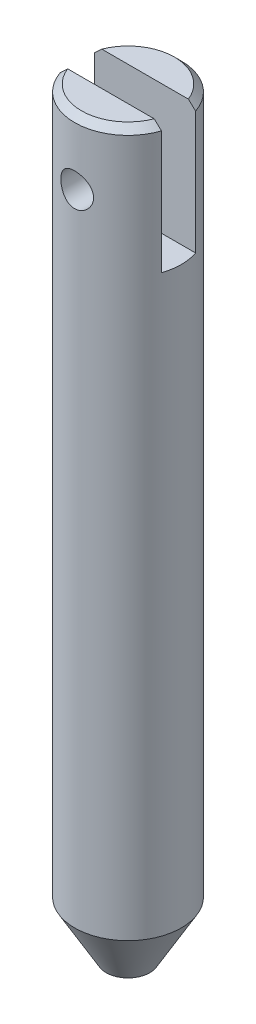
ISO-10303-21;
HEADER;
FILE_DESCRIPTION(('STEP AP214'),'2;1');
FILE_NAME('part.step','',(''),(''),'','','');
FILE_SCHEMA(('AUTOMOTIVE_DESIGN { 1 0 10303 214 1 1 1 1 }'));
ENDSEC;
DATA;
#1=APPLICATION_CONTEXT('core data for automotive mechanical design processes');
#2=APPLICATION_PROTOCOL_DEFINITION('international standard','automotive_design',2000,#1);
#3=PRODUCT_CONTEXT('',#1,'mechanical');
#4=PRODUCT('Part','Part','',(#3));
#5=PRODUCT_RELATED_PRODUCT_CATEGORY('part','',(#4));
#6=PRODUCT_DEFINITION_FORMATION('','',#4);
#7=PRODUCT_DEFINITION_CONTEXT('part definition',#1,'design');
#8=PRODUCT_DEFINITION('design','',#6,#7);
#9=PRODUCT_DEFINITION_SHAPE('','',#8);
#10=(LENGTH_UNIT() NAMED_UNIT(*) SI_UNIT(.MILLI.,.METRE.));
#11=(NAMED_UNIT(*) PLANE_ANGLE_UNIT() SI_UNIT($,.RADIAN.));
#12=(NAMED_UNIT(*) SI_UNIT($,.STERADIAN.) SOLID_ANGLE_UNIT());
#13=UNCERTAINTY_MEASURE_WITH_UNIT(LENGTH_MEASURE(1.E-05),#10,'distance_accuracy_value','');
#14=(GEOMETRIC_REPRESENTATION_CONTEXT(3) GLOBAL_UNCERTAINTY_ASSIGNED_CONTEXT((#13)) GLOBAL_UNIT_ASSIGNED_CONTEXT((#10,
#11,#12)) REPRESENTATION_CONTEXT('',''));
#15=CARTESIAN_POINT('',(0.,0.,0.));
#16=DIRECTION('',(0.,0.,1.));
#17=DIRECTION('',(1.,0.,0.));
#18=AXIS2_PLACEMENT_3D('',#15,#16,#17);
#19=CARTESIAN_POINT('',(0.,-55.6,0.));
#20=DIRECTION('',(0.,-1.,0.));
#21=DIRECTION('',(0.,0.,-1.));
#22=AXIS2_PLACEMENT_3D('',#19,#20,#21);
#23=PLANE('',#22);
#24=CARTESIAN_POINT('',(0.,-55.6000000000267,0.));
#25=DIRECTION('',(0.,1.,0.));
#26=DIRECTION('',(-1.,0.,0.));
#27=AXIS2_PLACEMENT_3D('',#24,#25,#26);
#28=CIRCLE('',#27,1.60059892323261);
#29=CARTESIAN_POINT('',(-1.60059892323261,-55.6000000000267,0.));
#30=VERTEX_POINT('',#29);
#31=EDGE_CURVE('E83',#30,#30,#28,.T.);
#32=ORIENTED_EDGE('',*,*,#31,.F.);
#33=EDGE_LOOP('',(#32));
#34=FACE_BOUND('',#33,.T.);
#35=ADVANCED_FACE('F16',(#34),#23,.T.);
#36=CARTESIAN_POINT('',(0.,0.,0.));
#37=DIRECTION('',(0.,1.,0.));
#38=DIRECTION('',(0.,0.,1.));
#39=AXIS2_PLACEMENT_3D('',#36,#37,#38);
#40=PLANE('',#39);
#41=CARTESIAN_POINT('',(0.,-5.6843418860808E-11,0.));
#42=DIRECTION('',(0.,-1.,0.));
#43=DIRECTION('',(0.,0.,-1.));
#44=AXIS2_PLACEMENT_3D('',#41,#42,#43);
#45=CIRCLE('',#44,3.41000000003078);
#46=CARTESIAN_POINT('',(-3.17263297595533,-4.35386597477304E-11,-1.25));
#47=VERTEX_POINT('',#46);
#48=CARTESIAN_POINT('',(3.17263297593908,-2.8421709430404E-11,-1.25));
#49=VERTEX_POINT('',#48);
#50=EDGE_CURVE('E77',#47,#49,#45,.T.);
#51=ORIENTED_EDGE('',*,*,#50,.F.);
#52=DIRECTION('',(-1.,0.,0.));
#53=VECTOR('',#52,1.);
#54=CARTESIAN_POINT('',(-3.70480768731657,0.,-1.25));
#55=LINE('',#54,#53);
#56=EDGE_CURVE('E80',#47,#49,#55,.F.);
#57=ORIENTED_EDGE('',*,*,#56,.T.);
#58=EDGE_LOOP('',(#51,#57));
#59=FACE_BOUND('',#58,.T.);
#60=ADVANCED_FACE('F78',(#59),#40,.T.);
#61=CARTESIAN_POINT('',(0.,0.,0.));
#62=DIRECTION('',(0.,1.,0.));
#63=DIRECTION('',(0.,0.,1.));
#64=AXIS2_PLACEMENT_3D('',#61,#62,#63);
#65=PLANE('',#64);
#66=DIRECTION('',(1.,0.,0.));
#67=VECTOR('',#66,1.);
#68=CARTESIAN_POINT('',(-3.70480768731658,0.,1.25));
#69=LINE('',#68,#67);
#70=CARTESIAN_POINT('',(3.17263297595096,-3.94731268170688E-11,1.25));
#71=VERTEX_POINT('',#70);
#72=CARTESIAN_POINT('',(-3.17263297593908,-2.8421709430404E-11,1.25));
#73=VERTEX_POINT('',#72);
#74=EDGE_CURVE('E156',#71,#73,#69,.F.);
#75=ORIENTED_EDGE('',*,*,#74,.T.);
#76=CARTESIAN_POINT('',(0.,-5.6843418860808E-11,0.));
#77=DIRECTION('',(0.,-1.,0.));
#78=DIRECTION('',(0.,0.,-1.));
#79=AXIS2_PLACEMENT_3D('',#76,#77,#78);
#80=CIRCLE('',#79,3.41000000003078);
#81=EDGE_CURVE('E89',#71,#73,#80,.T.);
#82=ORIENTED_EDGE('',*,*,#81,.F.);
#83=EDGE_LOOP('',(#75,#82));
#84=FACE_BOUND('',#83,.T.);
#85=ADVANCED_FACE('F162',(#84),#65,.T.);
#86=CARTESIAN_POINT('',(0.,-0.50000000004502,0.));
#87=DIRECTION('',(0.,-1.,0.));
#88=DIRECTION('',(0.,0.,-1.));
#89=AXIS2_PLACEMENT_3D('',#86,#87,#88);
#90=CONICAL_SURFACE('',#89,3.91000000001895,0.785398163397448);
#91=CARTESIAN_POINT('',(-3.17263297593229,-2.21038523908453E-11,1.25));
#92=CARTESIAN_POINT('',(-3.21718377374796,-0.0414502674763203,1.25));
#93=CARTESIAN_POINT('',(-3.26167664671908,-0.0829627251358861,1.25));
#94=CARTESIAN_POINT('',(-3.35055742833952,-0.166099409545555,1.25));
#95=CARTESIAN_POINT('',(-3.39494533752697,-0.207723635720303,1.25));
#96=CARTESIAN_POINT('',(-3.48362749109901,-0.291071631225922,1.25));
#97=CARTESIAN_POINT('',(-3.52792173557526,-0.332795400459289,1.25));
#98=CARTESIAN_POINT('',(-3.61642582244306,-0.416332820839537,1.25));
#99=CARTESIAN_POINT('',(-3.66063566440008,-0.458146472446805,1.25));
#100=CARTESIAN_POINT('',(-3.70480768730356,-0.500000000013731,1.25));
#101=B_SPLINE_CURVE_WITH_KNOTS('',3,(#91,#92,#93,#94,#95,#96,#97,#98,#99,#100),.UNSPECIFIED.,
.F.,.F.,(4,2,2,2,4),(0.,0.182554207026802,0.365107476108087,0.547660566448,0.730214594082766),.UNSPECIFIED.);
#102=CARTESIAN_POINT('',(-3.70480768731007,-0.500000000006866,1.25));
#103=VERTEX_POINT('',#102);
#104=EDGE_CURVE('E149',#73,#103,#101,.T.);
#105=ORIENTED_EDGE('',*,*,#104,.T.);
#106=CARTESIAN_POINT('',(0.,-0.499999999999987,0.));
#107=DIRECTION('',(0.,-1.,0.));
#108=DIRECTION('',(0.,0.,-1.));
#109=AXIS2_PLACEMENT_3D('',#106,#107,#108);
#110=CIRCLE('',#109,3.91);
#111=CARTESIAN_POINT('',(3.70480768731007,-0.500000000006858,1.25));
#112=VERTEX_POINT('',#111);
#113=EDGE_CURVE('E217',#112,#103,#110,.T.);
#114=ORIENTED_EDGE('',*,*,#113,.F.);
#115=CARTESIAN_POINT('',(3.70480768730356,-0.500000000013728,1.25));
#116=CARTESIAN_POINT('',(3.66063566440008,-0.458146472446803,1.25));
#117=CARTESIAN_POINT('',(3.61642582244306,-0.416332820839535,1.25));
#118=CARTESIAN_POINT('',(3.52792173557526,-0.332795400459288,1.25));
#119=CARTESIAN_POINT('',(3.48362749109901,-0.291071631225921,1.25));
#120=CARTESIAN_POINT('',(3.39494533752697,-0.207723635720302,1.25));
#121=CARTESIAN_POINT('',(3.35055742833952,-0.166099409545554,1.25));
#122=CARTESIAN_POINT('',(3.26167664671907,-0.0829627251358853,1.25));
#123=CARTESIAN_POINT('',(3.21718377374796,-0.0414502674763195,1.25));
#124=CARTESIAN_POINT('',(3.17263297593229,-2.21028607428023E-11,1.25));
#125=B_SPLINE_CURVE_WITH_KNOTS('',3,(#115,#116,#117,#118,#119,#120,#121,#122,#123,#124),
.UNSPECIFIED.,.F.,.F.,(4,2,2,2,4),(0.,0.182554027634765,0.365107117974678,0.547660387055963,
0.730214594082764),.UNSPECIFIED.);
#126=EDGE_CURVE('E142',#112,#71,#125,.T.);
#127=ORIENTED_EDGE('',*,*,#126,.T.);
#128=ORIENTED_EDGE('',*,*,#81,.T.);
#129=EDGE_LOOP('',(#105,#114,#127,#128));
#130=FACE_BOUND('',#129,.T.);
#131=ADVANCED_FACE('F157',(#130),#90,.T.);
#132=CARTESIAN_POINT('',(0.,-4.76,3.91));
#133=DIRECTION('',(0.,0.,-1.));
#134=DIRECTION('',(-1.,0.,0.));
#135=AXIS2_PLACEMENT_3D('',#132,#133,#134);
#136=CYLINDRICAL_SURFACE('',#135,1.2);
#137=CARTESIAN_POINT('',(0.,-4.76,1.25));
#138=DIRECTION('',(0.,0.,-1.));
#139=DIRECTION('',(-1.,0.,0.));
#140=AXIS2_PLACEMENT_3D('',#137,#138,#139);
#141=CIRCLE('',#140,1.2);
#142=CARTESIAN_POINT('',(-1.2,-4.76,1.25));
#143=VERTEX_POINT('',#142);
#144=EDGE_CURVE('E211',#143,#143,#141,.T.);
#145=ORIENTED_EDGE('',*,*,#144,.T.);
#146=EDGE_LOOP('',(#145));
#147=FACE_BOUND('',#146,.T.);
#148=CARTESIAN_POINT('',(0.,-3.56,3.91));
#149=CARTESIAN_POINT('',(0.065722378512767,-3.56000280389594,3.90999807145559));
#150=CARTESIAN_POINT('',(0.131479183145352,-3.5654203888806,3.90832598380927));
#151=CARTESIAN_POINT('',(0.261101907980637,-3.58690562613876,3.90181358646052));
#152=CARTESIAN_POINT('',(0.324966062811949,-3.60298291368633,3.89697041047006));
#153=CARTESIAN_POINT('',(0.448872965856192,-3.64519553262783,3.88464723393661));
#154=CARTESIAN_POINT('',(0.508922239038861,-3.67131312016367,3.87717188708176));
#155=CARTESIAN_POINT('',(0.623778999144302,-3.73279749118392,3.86035923757977));
#156=CARTESIAN_POINT('',(0.678586502320682,-3.76816424598737,3.85102194070642));
#157=CARTESIAN_POINT('',(0.783053518515575,-3.84825714959003,3.83116593701344));
#158=CARTESIAN_POINT('',(0.832534750568688,-3.8932096039702,3.82062219502528));
#159=CARTESIAN_POINT('',(0.923397701988342,-3.99072767633101,3.79968627814832));
#160=CARTESIAN_POINT('',(0.964776372994426,-4.04329614673171,3.78929416165996));
#161=CARTESIAN_POINT('',(1.03921589947752,-4.15609128196176,3.76956924464955));
#162=CARTESIAN_POINT('',(1.07205234305194,-4.21647193692835,3.76026799729355));
#163=CARTESIAN_POINT('',(1.12700104610112,-4.34219346183846,3.74416830205214));
#164=CARTESIAN_POINT('',(1.14912632294408,-4.40752819873241,3.73736681861763));
#165=CARTESIAN_POINT('',(1.17693492326708,-4.52097540041954,3.72868103568987));
#166=CARTESIAN_POINT('',(1.18556731647261,-4.56831921209903,3.72593167156208));
#167=CARTESIAN_POINT('',(1.19710070715213,-4.66376918818745,3.72224213778086));
#168=CARTESIAN_POINT('',(1.200002103363,-4.71187529932425,3.72130184226072));
#169=CARTESIAN_POINT('',(1.19999713109093,-4.82564030574186,3.7213058439595));
#170=CARTESIAN_POINT('',(1.19459260678549,-4.89131519536456,3.72306062298777));
#171=CARTESIAN_POINT('',(1.17316397277972,-5.02076744026995,3.72986690715028));
#172=CARTESIAN_POINT('',(1.15712993661872,-5.0845429635867,3.73492149377082));
#173=CARTESIAN_POINT('',(1.11504363344616,-5.20826185270835,3.74770019142344));
#174=CARTESIAN_POINT('',(1.0890110672815,-5.26821248579201,3.75541904983145));
#175=CARTESIAN_POINT('',(1.02772739517388,-5.38290124926764,3.77264964549501));
#176=CARTESIAN_POINT('',(0.992476127922138,-5.4376392884268,3.78216141412207));
#177=CARTESIAN_POINT('',(0.912505024256181,-5.54217254066448,3.80225999182101));
#178=CARTESIAN_POINT('',(0.867532844963987,-5.59177019136253,3.8128704923336));
#179=CARTESIAN_POINT('',(0.769925039298974,-5.68286130204585,3.83377136371792));
#180=CARTESIAN_POINT('',(0.717286876858446,-5.72435206942634,3.84406162727594));
#181=CARTESIAN_POINT('',(0.604418742837527,-5.79891936565901,3.8634344442746));
#182=CARTESIAN_POINT('',(0.544046572995955,-5.8317894255578,3.87248524093107));
#183=CARTESIAN_POINT('',(0.418342401373228,-5.88680273412799,3.88806934654223));
#184=CARTESIAN_POINT('',(0.353016346938896,-5.90895861696445,3.89460561875617));
#185=CARTESIAN_POINT('',(0.239490527463797,-5.93684444053757,3.90294098432303));
#186=CARTESIAN_POINT('',(0.192052632812199,-5.94551100493052,3.90557371341182));
#187=CARTESIAN_POINT('',(0.0964159724672516,-5.95708964641945,3.90910387839514));
#188=CARTESIAN_POINT('',(0.0482172510417467,-5.96000205707945,3.91000141487743));
#189=CARTESIAN_POINT('',(-0.0657223785127661,-5.95999719610406,3.90999807145559));
#190=CARTESIAN_POINT('',(-0.131479183145351,-5.95457961111941,3.90832598380927));
#191=CARTESIAN_POINT('',(-0.261101907980636,-5.93309437386124,3.90181358646052));
#192=CARTESIAN_POINT('',(-0.324966062811948,-5.91701708631367,3.89697041047006));
#193=CARTESIAN_POINT('',(-0.448872965856191,-5.87480446737217,3.88464723393661));
#194=CARTESIAN_POINT('',(-0.50892223903886,-5.84868687983633,3.87717188708176));
#195=CARTESIAN_POINT('',(-0.623778999144301,-5.78720250881608,3.86035923757977));
#196=CARTESIAN_POINT('',(-0.678586502320682,-5.75183575401263,3.85102194070642));
#197=CARTESIAN_POINT('',(-0.783053518515574,-5.67174285040997,3.83116593701344));
#198=CARTESIAN_POINT('',(-0.832534750568688,-5.6267903960298,3.82062219502528));
#199=CARTESIAN_POINT('',(-0.923397701988341,-5.529272323669,3.79968627814832));
#200=CARTESIAN_POINT('',(-0.964776372994426,-5.47670385326829,3.78929416165996));
#201=CARTESIAN_POINT('',(-1.03921589947752,-5.36390871803824,3.76956924464955));
#202=CARTESIAN_POINT('',(-1.07205234305194,-5.30352806307166,3.76026799729355));
#203=CARTESIAN_POINT('',(-1.12700104610112,-5.17780653816154,3.74416830205214));
#204=CARTESIAN_POINT('',(-1.14912632294408,-5.11247180126759,3.73736681861763));
#205=CARTESIAN_POINT('',(-1.17693492326708,-4.99902459958046,3.72868103568987));
#206=CARTESIAN_POINT('',(-1.18556731647261,-4.95168078790098,3.72593167156208));
#207=CARTESIAN_POINT('',(-1.19710070715213,-4.85623081181257,3.72224213778086));
#208=CARTESIAN_POINT('',(-1.200002103363,-4.80812470067577,3.72130184226072));
#209=CARTESIAN_POINT('',(-1.19999713109093,-4.69435969425817,3.7213058439595));
#210=CARTESIAN_POINT('',(-1.19459260678549,-4.62868480463546,3.72306062298777));
#211=CARTESIAN_POINT('',(-1.17316397277973,-4.49923255973007,3.72986690715028));
#212=CARTESIAN_POINT('',(-1.15712993661873,-4.43545703641332,3.73492149377082));
#213=CARTESIAN_POINT('',(-1.11504363344617,-4.31173814729167,3.74770019142344));
#214=CARTESIAN_POINT('',(-1.08901106728151,-4.25178751420801,3.75541904983145));
#215=CARTESIAN_POINT('',(-1.02772739517389,-4.13709875073239,3.772649645495));
#216=CARTESIAN_POINT('',(-0.992476127922152,-4.08236071157322,3.78216141412207));
#217=CARTESIAN_POINT('',(-0.912505024256197,-3.97782745933554,3.80225999182101));
#218=CARTESIAN_POINT('',(-0.867532844964004,-3.92822980863749,3.81287049233359));
#219=CARTESIAN_POINT('',(-0.769925039298994,-3.83713869795417,3.83377136371792));
#220=CARTESIAN_POINT('',(-0.717286876858466,-3.79564793057368,3.84406162727594));
#221=CARTESIAN_POINT('',(-0.604418742837549,-3.721080634341,3.8634344442746));
#222=CARTESIAN_POINT('',(-0.544046572995979,-3.68821057444222,3.87248524093107));
#223=CARTESIAN_POINT('',(-0.418342401373253,-3.63319726587202,3.88806934654223));
#224=CARTESIAN_POINT('',(-0.353016346938921,-3.61104138303556,3.89460561875617));
#225=CARTESIAN_POINT('',(-0.239490527463819,-3.58315555946243,3.90294098432303));
#226=CARTESIAN_POINT('',(-0.192052632812217,-3.57448899506948,3.90557371341182));
#227=CARTESIAN_POINT('',(-0.0964159724672605,-3.56291035358055,3.90910387839514));
#228=CARTESIAN_POINT('',(-0.0482172510417508,-3.55999794292055,3.91000141487743));
#229=CARTESIAN_POINT('',(0.,-3.56,3.91));
#230=B_SPLINE_CURVE_WITH_KNOTS('',3,(#148,#149,#150,#151,#152,#153,#154,#155,#156,#157,#158,
#159,#160,#161,#162,#163,#164,#165,#166,#167,#168,#169,#170,#171,#172,#173,#174,#175,#176,#177,
#178,#179,#180,#181,#182,#183,#184,#185,#186,#187,#188,#189,#190,#191,#192,#193,#194,#195,#196,
#197,#198,#199,#200,#201,#202,#203,#204,#205,#206,#207,#208,#209,#210,#211,#212,#213,#214,#215,
#216,#217,#218,#219,#220,#221,#222,#223,#224,#225,#226,#227,#228,#229),.UNSPECIFIED.,.T.,.F.,(4,
2,2,2,2,2,2,2,2,2,2,2,2,2,2,2,2,2,2,2,2,2,2,2,2,2,2,2,2,2,2,2,2,2,2,2,2,2,2,2,4),(0.,
0.196986922491724,0.3941521440725,0.590970512758818,0.787788271133657,0.989903848793997,
1.19209532126549,1.3991580279064,1.60596845385973,1.7502200828624,1.89446167513482,
2.09120185397245,2.28812601961167,2.484664145164,2.68120570996956,2.88364384094696,
3.08614909546892,3.29313465126073,3.49987553073289,3.64440344890142,3.78892298864814,
3.98590991113986,4.18307513272064,4.37989350140696,4.5767112597818,4.77882683744214,
4.98101830991363,5.18808101655454,5.39489144250787,5.53914307151052,5.68338466378293,
5.88012484262057,6.07704900825979,6.27358713381212,6.47012869861768,6.67256682959507,
6.87507208411703,7.08205763990884,7.288798519381,7.43332643754955,7.57784597729628),.UNSPECIFIED.);
#231=CARTESIAN_POINT('',(0.,-3.56,3.91));
#232=VERTEX_POINT('',#231);
#233=EDGE_CURVE('E110',#232,#232,#230,.T.);
#234=ORIENTED_EDGE('',*,*,#233,.F.);
#235=EDGE_LOOP('',(#234));
#236=FACE_BOUND('',#235,.T.);
#237=ADVANCED_FACE('F161',(#147,#236),#136,.F.);
#238=CARTESIAN_POINT('',(0.,-51.5999999999508,0.));
#239=DIRECTION('',(0.,1.,0.));
#240=DIRECTION('',(-1.,0.,0.));
#241=AXIS2_PLACEMENT_3D('',#238,#239,#240);
#242=CONICAL_SURFACE('',#241,3.91000000001895,0.523598775595298);
#243=CARTESIAN_POINT('',(0.,-51.6,0.));
#244=DIRECTION('',(0.,-1.,0.));
#245=DIRECTION('',(0.,0.,-1.));
#246=AXIS2_PLACEMENT_3D('',#243,#244,#245);
#247=CIRCLE('',#246,3.91);
#248=CARTESIAN_POINT('',(0.,-51.6,-3.91));
#249=VERTEX_POINT('',#248);
#250=EDGE_CURVE('E107',#249,#249,#247,.F.);
#251=ORIENTED_EDGE('',*,*,#250,.F.);
#252=EDGE_LOOP('',(#251));
#253=FACE_BOUND('',#252,.T.);
#254=ORIENTED_EDGE('',*,*,#31,.T.);
#255=EDGE_LOOP('',(#254));
#256=FACE_BOUND('',#255,.T.);
#257=ADVANCED_FACE('F196',(#253,#256),#242,.T.);
#258=CARTESIAN_POINT('',(0.,-4.76,3.91));
#259=DIRECTION('',(0.,0.,-1.));
#260=DIRECTION('',(-1.,0.,0.));
#261=AXIS2_PLACEMENT_3D('',#258,#259,#260);
#262=CYLINDRICAL_SURFACE('',#261,1.2);
#263=CARTESIAN_POINT('',(0.,-4.76,-1.25));
#264=DIRECTION('',(0.,0.,-1.));
#265=DIRECTION('',(-1.,0.,0.));
#266=AXIS2_PLACEMENT_3D('',#263,#264,#265);
#267=CIRCLE('',#266,1.2);
#268=CARTESIAN_POINT('',(-1.2,-4.76,-1.25));
#269=VERTEX_POINT('',#268);
#270=EDGE_CURVE('E82',#269,#269,#267,.F.);
#271=ORIENTED_EDGE('',*,*,#270,.T.);
#272=EDGE_LOOP('',(#271));
#273=FACE_BOUND('',#272,.T.);
#274=CARTESIAN_POINT('',(0.,-5.96,-3.91));
#275=CARTESIAN_POINT('',(0.0657223785127667,-5.95999719610406,-3.90999807145559));
#276=CARTESIAN_POINT('',(0.131479183145352,-5.95457961111941,-3.90832598380927));
#277=CARTESIAN_POINT('',(0.261101907980637,-5.93309437386124,-3.90181358646052));
#278=CARTESIAN_POINT('',(0.324966062811949,-5.91701708631367,-3.89697041047006));
#279=CARTESIAN_POINT('',(0.448872965856192,-5.87480446737217,-3.88464723393661));
#280=CARTESIAN_POINT('',(0.508922239038861,-5.84868687983633,-3.87717188708176));
#281=CARTESIAN_POINT('',(0.623778999144302,-5.78720250881608,-3.86035923757977));
#282=CARTESIAN_POINT('',(0.678586502320682,-5.75183575401263,-3.85102194070642));
#283=CARTESIAN_POINT('',(0.783053518515574,-5.67174285040997,-3.83116593701344));
#284=CARTESIAN_POINT('',(0.832534750568688,-5.6267903960298,-3.82062219502528));
#285=CARTESIAN_POINT('',(0.923397701988341,-5.529272323669,-3.79968627814832));
#286=CARTESIAN_POINT('',(0.964776372994426,-5.47670385326829,-3.78929416165996));
#287=CARTESIAN_POINT('',(1.03921589947752,-5.36390871803824,-3.76956924464955));
#288=CARTESIAN_POINT('',(1.07205234305194,-5.30352806307166,-3.76026799729355));
#289=CARTESIAN_POINT('',(1.12700104610112,-5.17780653816154,-3.74416830205214));
#290=CARTESIAN_POINT('',(1.14912632294408,-5.11247180126759,-3.73736681861762));
#291=CARTESIAN_POINT('',(1.17693492326708,-4.99902459958046,-3.72868103568987));
#292=CARTESIAN_POINT('',(1.18556731647261,-4.95168078790097,-3.72593167156208));
#293=CARTESIAN_POINT('',(1.19710070715213,-4.85623081181255,-3.72224213778086));
#294=CARTESIAN_POINT('',(1.200002103363,-4.80812470067575,-3.72130184226072));
#295=CARTESIAN_POINT('',(1.19999713109093,-4.69435969425814,-3.7213058439595));
#296=CARTESIAN_POINT('',(1.19459260678549,-4.62868480463544,-3.72306062298777));
#297=CARTESIAN_POINT('',(1.17316397277972,-4.49923255973005,-3.72986690715028));
#298=CARTESIAN_POINT('',(1.15712993661872,-4.4354570364133,-3.73492149377082));
#299=CARTESIAN_POINT('',(1.11504363344617,-4.31173814729165,-3.74770019142344));
#300=CARTESIAN_POINT('',(1.0890110672815,-4.25178751420799,-3.75541904983145));
#301=CARTESIAN_POINT('',(1.02772739517388,-4.13709875073237,-3.77264964549501));
#302=CARTESIAN_POINT('',(0.992476127922139,-4.0823607115732,-3.78216141412207));
#303=CARTESIAN_POINT('',(0.912505024256181,-3.97782745933552,-3.80225999182101));
#304=CARTESIAN_POINT('',(0.867532844963987,-3.92822980863747,-3.8128704923336));
#305=CARTESIAN_POINT('',(0.769925039298974,-3.83713869795416,-3.83377136371792));
#306=CARTESIAN_POINT('',(0.717286876858446,-3.79564793057367,-3.84406162727594));
#307=CARTESIAN_POINT('',(0.604418742837527,-3.72108063434099,-3.8634344442746));
#308=CARTESIAN_POINT('',(0.544046572995956,-3.6882105744422,-3.87248524093107));
#309=CARTESIAN_POINT('',(0.418342401373229,-3.63319726587201,-3.88806934654223));
#310=CARTESIAN_POINT('',(0.353016346938896,-3.61104138303555,-3.89460561875617));
#311=CARTESIAN_POINT('',(0.239490527463797,-3.58315555946243,-3.90294098432303));
#312=CARTESIAN_POINT('',(0.192052632812199,-3.57448899506948,-3.90557371341182));
#313=CARTESIAN_POINT('',(0.0964159724672515,-3.56291035358055,-3.90910387839514));
#314=CARTESIAN_POINT('',(0.0482172510417463,-3.55999794292055,-3.91000141487743));
#315=CARTESIAN_POINT('',(-0.065722378512767,-3.56000280389594,-3.90999807145559));
#316=CARTESIAN_POINT('',(-0.131479183145352,-3.5654203888806,-3.90832598380927));
#317=CARTESIAN_POINT('',(-0.261101907980637,-3.58690562613876,-3.90181358646052));
#318=CARTESIAN_POINT('',(-0.324966062811949,-3.60298291368633,-3.89697041047006));
#319=CARTESIAN_POINT('',(-0.448872965856192,-3.64519553262783,-3.88464723393661));
#320=CARTESIAN_POINT('',(-0.508922239038861,-3.67131312016367,-3.87717188708176));
#321=CARTESIAN_POINT('',(-0.623778999144303,-3.73279749118392,-3.86035923757977));
#322=CARTESIAN_POINT('',(-0.678586502320683,-3.76816424598737,-3.85102194070642));
#323=CARTESIAN_POINT('',(-0.783053518515575,-3.84825714959003,-3.83116593701344));
#324=CARTESIAN_POINT('',(-0.832534750568688,-3.8932096039702,-3.82062219502528));
#325=CARTESIAN_POINT('',(-0.923397701988341,-3.99072767633101,-3.79968627814832));
#326=CARTESIAN_POINT('',(-0.964776372994426,-4.04329614673171,-3.78929416165996));
#327=CARTESIAN_POINT('',(-1.03921589947752,-4.15609128196176,-3.76956924464955));
#328=CARTESIAN_POINT('',(-1.07205234305194,-4.21647193692835,-3.76026799729355));
#329=CARTESIAN_POINT('',(-1.12700104610112,-4.34219346183846,-3.74416830205214));
#330=CARTESIAN_POINT('',(-1.14912632294408,-4.40752819873241,-3.73736681861762));
#331=CARTESIAN_POINT('',(-1.17693492326708,-4.52097540041954,-3.72868103568987));
#332=CARTESIAN_POINT('',(-1.18556731647261,-4.56831921209902,-3.72593167156208));
#333=CARTESIAN_POINT('',(-1.19710070715213,-4.66376918818743,-3.72224213778086));
#334=CARTESIAN_POINT('',(-1.200002103363,-4.71187529932423,-3.72130184226072));
#335=CARTESIAN_POINT('',(-1.19999713109093,-4.82564030574183,-3.7213058439595));
#336=CARTESIAN_POINT('',(-1.19459260678549,-4.89131519536454,-3.72306062298777));
#337=CARTESIAN_POINT('',(-1.17316397277972,-5.02076744026993,-3.72986690715028));
#338=CARTESIAN_POINT('',(-1.15712993661873,-5.08454296358668,-3.73492149377082));
#339=CARTESIAN_POINT('',(-1.11504363344617,-5.20826185270833,-3.74770019142344));
#340=CARTESIAN_POINT('',(-1.08901106728151,-5.26821248579199,-3.75541904983145));
#341=CARTESIAN_POINT('',(-1.02772739517389,-5.38290124926761,-3.77264964549501));
#342=CARTESIAN_POINT('',(-0.992476127922152,-5.43763928842677,-3.78216141412207));
#343=CARTESIAN_POINT('',(-0.912505024256196,-5.54217254066446,-3.80225999182101));
#344=CARTESIAN_POINT('',(-0.867532844964004,-5.59177019136251,-3.81287049233359));
#345=CARTESIAN_POINT('',(-0.769925039298993,-5.68286130204583,-3.83377136371792));
#346=CARTESIAN_POINT('',(-0.717286876858465,-5.72435206942632,-3.84406162727594));
#347=CARTESIAN_POINT('',(-0.604418742837549,-5.798919365659,-3.8634344442746));
#348=CARTESIAN_POINT('',(-0.544046572995979,-5.83178942555778,-3.87248524093107));
#349=CARTESIAN_POINT('',(-0.418342401373253,-5.88680273412798,-3.88806934654223));
#350=CARTESIAN_POINT('',(-0.353016346938921,-5.90895861696444,-3.89460561875617));
#351=CARTESIAN_POINT('',(-0.239490527463818,-5.93684444053757,-3.90294098432303));
#352=CARTESIAN_POINT('',(-0.192052632812216,-5.94551100493052,-3.90557371341182));
#353=CARTESIAN_POINT('',(-0.0964159724672601,-5.95708964641945,-3.90910387839514));
#354=CARTESIAN_POINT('',(-0.0482172510417507,-5.96000205707945,-3.91000141487743));
#355=CARTESIAN_POINT('',(0.,-5.96,-3.91));
#356=B_SPLINE_CURVE_WITH_KNOTS('',3,(#274,#275,#276,#277,#278,#279,#280,#281,#282,#283,#284,
#285,#286,#287,#288,#289,#290,#291,#292,#293,#294,#295,#296,#297,#298,#299,#300,#301,#302,#303,
#304,#305,#306,#307,#308,#309,#310,#311,#312,#313,#314,#315,#316,#317,#318,#319,#320,#321,#322,
#323,#324,#325,#326,#327,#328,#329,#330,#331,#332,#333,#334,#335,#336,#337,#338,#339,#340,#341,
#342,#343,#344,#345,#346,#347,#348,#349,#350,#351,#352,#353,#354,#355),.UNSPECIFIED.,.T.,.F.,(4,
2,2,2,2,2,2,2,2,2,2,2,2,2,2,2,2,2,2,2,2,2,2,2,2,2,2,2,2,2,2,2,2,2,2,2,2,2,2,2,4),(0.,
0.196986922491723,0.3941521440725,0.590970512758818,0.787788271133657,0.989903848793996,
1.19209532126549,1.3991580279064,1.60596845385973,1.7502200828624,1.89446167513482,
2.09120185397245,2.28812601961167,2.484664145164,2.68120570996956,2.88364384094696,
3.08614909546892,3.29313465126073,3.49987553073289,3.64440344890142,3.78892298864814,
3.98590991113986,4.18307513272064,4.37989350140696,4.5767112597818,4.77882683744214,
4.98101830991363,5.18808101655454,5.39489144250788,5.53914307151052,5.68338466378293,
5.88012484262057,6.07704900825978,6.27358713381211,6.47012869861768,6.67256682959507,
6.87507208411703,7.08205763990884,7.288798519381,7.43332643754955,7.57784597729628),.UNSPECIFIED.);
#357=CARTESIAN_POINT('',(0.,-5.96,-3.91));
#358=VERTEX_POINT('',#357);
#359=EDGE_CURVE('E104',#358,#358,#356,.T.);
#360=ORIENTED_EDGE('',*,*,#359,.F.);
#361=EDGE_LOOP('',(#360));
#362=FACE_BOUND('',#361,.T.);
#363=ADVANCED_FACE('F125',(#273,#362),#262,.F.);
#364=CARTESIAN_POINT('',(0.,-0.50000000004502,0.));
#365=DIRECTION('',(0.,-1.,0.));
#366=DIRECTION('',(0.,0.,-1.));
#367=AXIS2_PLACEMENT_3D('',#364,#365,#366);
#368=CONICAL_SURFACE('',#367,3.91000000001895,0.785398163397448);
#369=CARTESIAN_POINT('',(3.17263297593229,-2.21035451735845E-11,-1.25));
#370=CARTESIAN_POINT('',(3.21718377374796,-0.0414502674763201,-1.25));
#371=CARTESIAN_POINT('',(3.26167664671908,-0.0829627251358862,-1.25));
#372=CARTESIAN_POINT('',(3.35055742833952,-0.166099409545555,-1.25));
#373=CARTESIAN_POINT('',(3.39494533752697,-0.207723635720304,-1.25));
#374=CARTESIAN_POINT('',(3.48362749109901,-0.291071631225923,-1.25));
#375=CARTESIAN_POINT('',(3.52792173557527,-0.33279540045929,-1.25));
#376=CARTESIAN_POINT('',(3.61642582244306,-0.416332820839538,-1.25));
#377=CARTESIAN_POINT('',(3.66063566440008,-0.458146472446806,-1.25));
#378=CARTESIAN_POINT('',(3.70480768730356,-0.500000000013732,-1.25));
#379=B_SPLINE_CURVE_WITH_KNOTS('',3,(#369,#370,#371,#372,#373,#374,#375,#376,#377,#378),
.UNSPECIFIED.,.F.,.F.,(4,2,2,2,4),(0.,0.182554207026802,0.365107476108088,0.547660566448002,
0.730214594082769),.UNSPECIFIED.);
#380=CARTESIAN_POINT('',(3.70480768731007,-0.500000000006866,-1.25));
#381=VERTEX_POINT('',#380);
#382=EDGE_CURVE('E93',#49,#381,#379,.T.);
#383=ORIENTED_EDGE('',*,*,#382,.T.);
#384=CARTESIAN_POINT('',(0.,-0.5,0.));
#385=DIRECTION('',(0.,-1.,0.));
#386=DIRECTION('',(0.,0.,-1.));
#387=AXIS2_PLACEMENT_3D('',#384,#385,#386);
#388=CIRCLE('',#387,3.91);
#389=CARTESIAN_POINT('',(-3.70480768731406,-0.500000000010641,-1.25));
#390=VERTEX_POINT('',#389);
#391=EDGE_CURVE('E72',#390,#381,#388,.T.);
#392=ORIENTED_EDGE('',*,*,#391,.F.);
#393=CARTESIAN_POINT('',(-3.70480768731154,-0.500000000021296,-1.25));
#394=CARTESIAN_POINT('',(-3.66063566440812,-0.458146472454419,-1.25));
#395=CARTESIAN_POINT('',(-3.61642582245116,-0.416332820847199,-1.25));
#396=CARTESIAN_POINT('',(-3.5279217355835,-0.332795400467048,-1.25));
#397=CARTESIAN_POINT('',(-3.4836274911073,-0.291071631233729,-1.25));
#398=CARTESIAN_POINT('',(-3.39494533753539,-0.207723635728203,-1.25));
#399=CARTESIAN_POINT('',(-3.350557428348,-0.166099409553502,-1.25));
#400=CARTESIAN_POINT('',(-3.26167664672769,-0.0829627251439254,-1.25));
#401=CARTESIAN_POINT('',(-3.21718377375664,-0.041450267484405,-1.25));
#402=CARTESIAN_POINT('',(-3.17263297594103,-3.02334798015237E-11,-1.25));
#403=B_SPLINE_CURVE_WITH_KNOTS('',3,(#393,#394,#395,#396,#397,#398,#399,#400,#401,#402),
.UNSPECIFIED.,.F.,.F.,(4,2,2,2,4),(0.,0.182554027634532,0.365107117974211,0.547660387055262,
0.73021459408183),.UNSPECIFIED.);
#404=EDGE_CURVE('E19',#390,#47,#403,.T.);
#405=ORIENTED_EDGE('',*,*,#404,.T.);
#406=ORIENTED_EDGE('',*,*,#50,.T.);
#407=EDGE_LOOP('',(#383,#392,#405,#406));
#408=FACE_BOUND('',#407,.T.);
#409=ADVANCED_FACE('F85',(#408),#368,.T.);
#410=CARTESIAN_POINT('',(-3.70480768731657,-9.5,-1.25));
#411=DIRECTION('',(0.,0.,-1.));
#412=DIRECTION('',(-1.,0.,0.));
#413=AXIS2_PLACEMENT_3D('',#410,#411,#412);
#414=PLANE('',#413);
#415=ORIENTED_EDGE('',*,*,#382,.F.);
#416=ORIENTED_EDGE('',*,*,#56,.F.);
#417=ORIENTED_EDGE('',*,*,#404,.F.);
#418=DIRECTION('',(0.,1.,0.));
#419=VECTOR('',#418,1.);
#420=CARTESIAN_POINT('',(-3.70480768731657,-9.5,-1.25));
#421=LINE('',#420,#419);
#422=CARTESIAN_POINT('',(-3.70480768731658,-9.5,-1.25));
#423=VERTEX_POINT('',#422);
#424=EDGE_CURVE('E94',#423,#390,#421,.T.);
#425=ORIENTED_EDGE('',*,*,#424,.F.);
#426=DIRECTION('',(1.,0.,0.));
#427=VECTOR('',#426,1.);
#428=CARTESIAN_POINT('',(0.,-9.5,-1.25));
#429=LINE('',#428,#427);
#430=CARTESIAN_POINT('',(3.70480768731658,-9.5,-1.25));
#431=VERTEX_POINT('',#430);
#432=EDGE_CURVE('E209',#431,#423,#429,.F.);
#433=ORIENTED_EDGE('',*,*,#432,.F.);
#434=DIRECTION('',(0.,-1.,0.));
#435=VECTOR('',#434,1.);
#436=CARTESIAN_POINT('',(3.70480768731658,0.,-1.25));
#437=LINE('',#436,#435);
#438=EDGE_CURVE('E100',#381,#431,#437,.T.);
#439=ORIENTED_EDGE('',*,*,#438,.F.);
#440=EDGE_LOOP('',(#415,#416,#417,#425,#433,#439));
#441=FACE_BOUND('',#440,.T.);
#442=ORIENTED_EDGE('',*,*,#270,.F.);
#443=EDGE_LOOP('',(#442));
#444=FACE_BOUND('',#443,.T.);
#445=ADVANCED_FACE('F90',(#441,#444),#414,.F.);
#446=CARTESIAN_POINT('',(0.,-9.5,0.));
#447=DIRECTION('',(0.,1.,0.));
#448=DIRECTION('',(0.,0.,1.));
#449=AXIS2_PLACEMENT_3D('',#446,#447,#448);
#450=PLANE('',#449);
#451=CARTESIAN_POINT('',(0.,-9.5,0.));
#452=DIRECTION('',(0.,-1.,0.));
#453=DIRECTION('',(0.,0.,-1.));
#454=AXIS2_PLACEMENT_3D('',#451,#452,#453);
#455=CIRCLE('',#454,3.91);
#456=CARTESIAN_POINT('',(3.70480768731658,-9.5,1.25));
#457=VERTEX_POINT('',#456);
#458=EDGE_CURVE('E31',#431,#457,#455,.T.);
#459=ORIENTED_EDGE('',*,*,#458,.F.);
#460=ORIENTED_EDGE('',*,*,#432,.T.);
#461=CARTESIAN_POINT('',(0.,-9.5,0.));
#462=DIRECTION('',(0.,-1.,0.));
#463=DIRECTION('',(0.,0.,-1.));
#464=AXIS2_PLACEMENT_3D('',#461,#462,#463);
#465=CIRCLE('',#464,3.91);
#466=CARTESIAN_POINT('',(-3.70480768731658,-9.5,1.25));
#467=VERTEX_POINT('',#466);
#468=EDGE_CURVE('E96',#423,#467,#465,.F.);
#469=ORIENTED_EDGE('',*,*,#468,.T.);
#470=DIRECTION('',(1.,0.,0.));
#471=VECTOR('',#470,1.);
#472=CARTESIAN_POINT('',(-3.70480768731658,-9.5,1.25));
#473=LINE('',#472,#471);
#474=EDGE_CURVE('E40',#467,#457,#473,.T.);
#475=ORIENTED_EDGE('',*,*,#474,.T.);
#476=EDGE_LOOP('',(#459,#460,#469,#475));
#477=FACE_BOUND('',#476,.T.);
#478=ADVANCED_FACE('F138',(#477),#450,.T.);
#479=CARTESIAN_POINT('',(-3.70480768731658,-9.5,1.25));
#480=DIRECTION('',(0.,0.,1.));
#481=DIRECTION('',(1.,0.,0.));
#482=AXIS2_PLACEMENT_3D('',#479,#480,#481);
#483=PLANE('',#482);
#484=ORIENTED_EDGE('',*,*,#104,.F.);
#485=ORIENTED_EDGE('',*,*,#74,.F.);
#486=ORIENTED_EDGE('',*,*,#126,.F.);
#487=DIRECTION('',(0.,-1.,0.));
#488=VECTOR('',#487,1.);
#489=CARTESIAN_POINT('',(3.70480768731658,0.,1.25));
#490=LINE('',#489,#488);
#491=EDGE_CURVE('E11',#457,#112,#490,.F.);
#492=ORIENTED_EDGE('',*,*,#491,.F.);
#493=ORIENTED_EDGE('',*,*,#474,.F.);
#494=DIRECTION('',(0.,1.,0.));
#495=VECTOR('',#494,1.);
#496=CARTESIAN_POINT('',(-3.70480768731658,-9.5,1.25));
#497=LINE('',#496,#495);
#498=EDGE_CURVE('E155',#103,#467,#497,.F.);
#499=ORIENTED_EDGE('',*,*,#498,.F.);
#500=EDGE_LOOP('',(#484,#485,#486,#492,#493,#499));
#501=FACE_BOUND('',#500,.T.);
#502=ORIENTED_EDGE('',*,*,#144,.F.);
#503=EDGE_LOOP('',(#502));
#504=FACE_BOUND('',#503,.T.);
#505=ADVANCED_FACE('F132',(#501,#504),#483,.F.);
#506=CARTESIAN_POINT('',(0.,0.,0.));
#507=DIRECTION('',(0.,-1.,0.));
#508=DIRECTION('',(0.,0.,-1.));
#509=AXIS2_PLACEMENT_3D('',#506,#507,#508);
#510=CYLINDRICAL_SURFACE('',#509,3.91);
#511=ORIENTED_EDGE('',*,*,#233,.T.);
#512=EDGE_LOOP('',(#511));
#513=FACE_BOUND('',#512,.T.);
#514=ORIENTED_EDGE('',*,*,#250,.T.);
#515=EDGE_LOOP('',(#514));
#516=FACE_BOUND('',#515,.T.);
#517=ORIENTED_EDGE('',*,*,#359,.T.);
#518=EDGE_LOOP('',(#517));
#519=FACE_BOUND('',#518,.T.);
#520=ORIENTED_EDGE('',*,*,#458,.T.);
#521=ORIENTED_EDGE('',*,*,#491,.T.);
#522=ORIENTED_EDGE('',*,*,#113,.T.);
#523=ORIENTED_EDGE('',*,*,#498,.T.);
#524=ORIENTED_EDGE('',*,*,#468,.F.);
#525=ORIENTED_EDGE('',*,*,#424,.T.);
#526=ORIENTED_EDGE('',*,*,#391,.T.);
#527=ORIENTED_EDGE('',*,*,#438,.T.);
#528=EDGE_LOOP('',(#520,#521,#522,#523,#524,#525,#526,#527));
#529=FACE_BOUND('',#528,.T.);
#530=ADVANCED_FACE('F128',(#513,#516,#519,#529),#510,.T.);
#531=CLOSED_SHELL('',(#35,#60,#85,#131,#237,#257,#363,#409,#445,#478,#505,#530));
#532=MANIFOLD_SOLID_BREP('B1',#531);
#533=ADVANCED_BREP_SHAPE_REPRESENTATION('',(#18,#532),#14);
#534=SHAPE_DEFINITION_REPRESENTATION(#9,#533);
ENDSEC;
END-ISO-10303-21;
